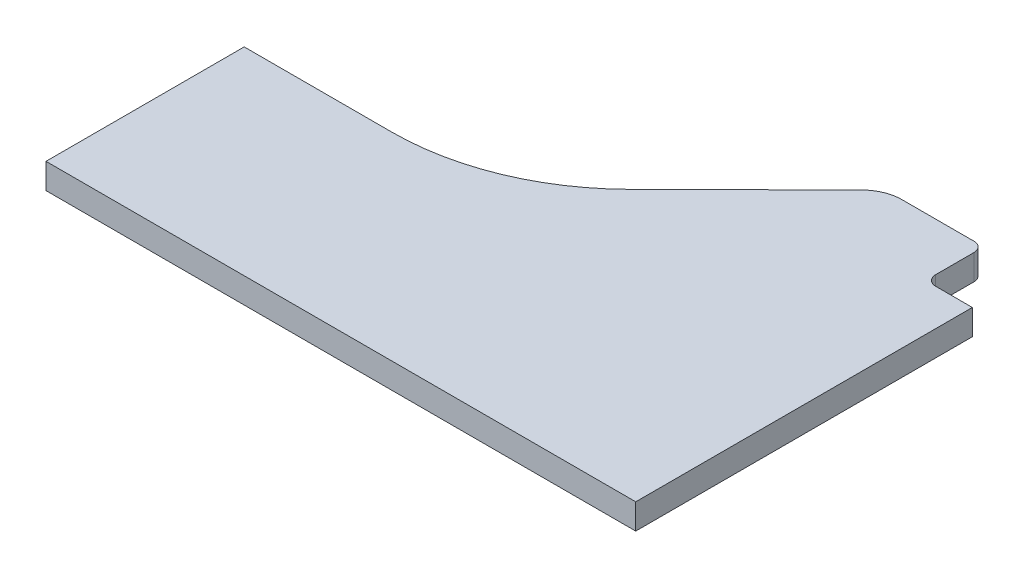
ISO-10303-21;
HEADER;
FILE_DESCRIPTION(('STEP AP214'),'2;1');
FILE_NAME('part.step','',(''),(''),'','','');
FILE_SCHEMA(('AUTOMOTIVE_DESIGN { 1 0 10303 214 1 1 1 1 }'));
ENDSEC;
DATA;
#1=APPLICATION_CONTEXT('core data for automotive mechanical design processes');
#2=APPLICATION_PROTOCOL_DEFINITION('international standard','automotive_design',2000,#1);
#3=PRODUCT_CONTEXT('',#1,'mechanical');
#4=PRODUCT('Part','Part','',(#3));
#5=PRODUCT_RELATED_PRODUCT_CATEGORY('part','',(#4));
#6=PRODUCT_DEFINITION_FORMATION('','',#4);
#7=PRODUCT_DEFINITION_CONTEXT('part definition',#1,'design');
#8=PRODUCT_DEFINITION('design','',#6,#7);
#9=PRODUCT_DEFINITION_SHAPE('','',#8);
#10=(LENGTH_UNIT() NAMED_UNIT(*) SI_UNIT(.MILLI.,.METRE.));
#11=(NAMED_UNIT(*) PLANE_ANGLE_UNIT() SI_UNIT($,.RADIAN.));
#12=(NAMED_UNIT(*) SI_UNIT($,.STERADIAN.) SOLID_ANGLE_UNIT());
#13=UNCERTAINTY_MEASURE_WITH_UNIT(LENGTH_MEASURE(1.E-05),#10,'distance_accuracy_value','');
#14=(GEOMETRIC_REPRESENTATION_CONTEXT(3) GLOBAL_UNCERTAINTY_ASSIGNED_CONTEXT((#13)) GLOBAL_UNIT_ASSIGNED_CONTEXT((#10,
#11,#12)) REPRESENTATION_CONTEXT('',''));
#15=CARTESIAN_POINT('',(0.,0.,0.));
#16=DIRECTION('',(0.,0.,1.));
#17=DIRECTION('',(1.,0.,0.));
#18=AXIS2_PLACEMENT_3D('',#15,#16,#17);
#19=CARTESIAN_POINT('',(0.,12.7,0.));
#20=DIRECTION('',(1.,0.,0.));
#21=DIRECTION('',(0.,0.,-1.));
#22=AXIS2_PLACEMENT_3D('',#19,#20,#21);
#23=PLANE('',#22);
#24=DIRECTION('',(0.,0.,1.));
#25=VECTOR('',#24,1.);
#26=CARTESIAN_POINT('',(0.,0.,0.));
#27=LINE('',#26,#25);
#28=CARTESIAN_POINT('',(0.,0.,-99.1471));
#29=VERTEX_POINT('',#28);
#30=CARTESIAN_POINT('',(0.,0.,0.));
#31=VERTEX_POINT('',#30);
#32=EDGE_CURVE('E153',#29,#31,#27,.T.);
#33=ORIENTED_EDGE('',*,*,#32,.T.);
#34=DIRECTION('',(0.,-1.,0.));
#35=VECTOR('',#34,1.);
#36=CARTESIAN_POINT('',(0.,12.7,0.));
#37=LINE('',#36,#35);
#38=CARTESIAN_POINT('',(0.,12.7,0.));
#39=VERTEX_POINT('',#38);
#40=EDGE_CURVE('E11',#39,#31,#37,.T.);
#41=ORIENTED_EDGE('',*,*,#40,.F.);
#42=DIRECTION('',(0.,0.,1.));
#43=VECTOR('',#42,1.);
#44=CARTESIAN_POINT('',(0.,12.7,0.));
#45=LINE('',#44,#43);
#46=CARTESIAN_POINT('',(0.,12.7,-99.1471));
#47=VERTEX_POINT('',#46);
#48=EDGE_CURVE('E175',#47,#39,#45,.T.);
#49=ORIENTED_EDGE('',*,*,#48,.F.);
#50=DIRECTION('',(0.,-1.,0.));
#51=VECTOR('',#50,1.);
#52=CARTESIAN_POINT('',(0.,12.7,-99.1471));
#53=LINE('',#52,#51);
#54=EDGE_CURVE('E149',#47,#29,#53,.T.);
#55=ORIENTED_EDGE('',*,*,#54,.T.);
#56=EDGE_LOOP('',(#33,#41,#49,#55));
#57=FACE_BOUND('',#56,.T.);
#58=ADVANCED_FACE('F33',(#57),#23,.F.);
#59=CARTESIAN_POINT('',(0.,12.7,0.));
#60=DIRECTION('',(0.,0.,-1.));
#61=DIRECTION('',(-1.,0.,0.));
#62=AXIS2_PLACEMENT_3D('',#59,#60,#61);
#63=PLANE('',#62);
#64=DIRECTION('',(1.,0.,0.));
#65=VECTOR('',#64,1.);
#66=CARTESIAN_POINT('',(0.,0.,0.));
#67=LINE('',#66,#65);
#68=CARTESIAN_POINT('',(295.,0.,0.));
#69=VERTEX_POINT('',#68);
#70=EDGE_CURVE('E156',#31,#69,#67,.T.);
#71=ORIENTED_EDGE('',*,*,#70,.T.);
#72=DIRECTION('',(0.,-1.,0.));
#73=VECTOR('',#72,1.);
#74=CARTESIAN_POINT('',(295.,12.7,0.));
#75=LINE('',#74,#73);
#76=CARTESIAN_POINT('',(295.,12.7,0.));
#77=VERTEX_POINT('',#76);
#78=EDGE_CURVE('E41',#77,#69,#75,.T.);
#79=ORIENTED_EDGE('',*,*,#78,.F.);
#80=DIRECTION('',(1.,0.,0.));
#81=VECTOR('',#80,1.);
#82=CARTESIAN_POINT('',(0.,12.7,0.));
#83=LINE('',#82,#81);
#84=EDGE_CURVE('E104',#39,#77,#83,.T.);
#85=ORIENTED_EDGE('',*,*,#84,.F.);
#86=ORIENTED_EDGE('',*,*,#40,.T.);
#87=EDGE_LOOP('',(#71,#79,#85,#86));
#88=FACE_BOUND('',#87,.T.);
#89=ADVANCED_FACE('F253',(#88),#63,.F.);
#90=CARTESIAN_POINT('',(295.,12.7,0.));
#91=DIRECTION('',(-1.,0.,0.));
#92=DIRECTION('',(0.,0.,1.));
#93=AXIS2_PLACEMENT_3D('',#90,#91,#92);
#94=PLANE('',#93);
#95=DIRECTION('',(0.,0.,-1.));
#96=VECTOR('',#95,1.);
#97=CARTESIAN_POINT('',(295.,0.,0.));
#98=LINE('',#97,#96);
#99=CARTESIAN_POINT('',(295.,0.,-168.379));
#100=VERTEX_POINT('',#99);
#101=EDGE_CURVE('E158',#69,#100,#98,.T.);
#102=ORIENTED_EDGE('',*,*,#101,.T.);
#103=DIRECTION('',(0.,-1.,0.));
#104=VECTOR('',#103,1.);
#105=CARTESIAN_POINT('',(295.,12.7,-168.379));
#106=LINE('',#105,#104);
#107=CARTESIAN_POINT('',(295.,12.7,-168.379));
#108=VERTEX_POINT('',#107);
#109=EDGE_CURVE('E194',#108,#100,#106,.T.);
#110=ORIENTED_EDGE('',*,*,#109,.F.);
#111=DIRECTION('',(0.,0.,-1.));
#112=VECTOR('',#111,1.);
#113=CARTESIAN_POINT('',(295.,12.7,0.));
#114=LINE('',#113,#112);
#115=EDGE_CURVE('E202',#77,#108,#114,.T.);
#116=ORIENTED_EDGE('',*,*,#115,.F.);
#117=ORIENTED_EDGE('',*,*,#78,.T.);
#118=EDGE_LOOP('',(#102,#110,#116,#117));
#119=FACE_BOUND('',#118,.T.);
#120=ADVANCED_FACE('F200',(#119),#94,.F.);
#121=CARTESIAN_POINT('',(295.,12.7,-168.379));
#122=DIRECTION('',(0.,0.,1.));
#123=DIRECTION('',(1.,0.,0.));
#124=AXIS2_PLACEMENT_3D('',#121,#122,#123);
#125=PLANE('',#124);
#126=DIRECTION('',(-1.,0.,0.));
#127=VECTOR('',#126,1.);
#128=CARTESIAN_POINT('',(295.,0.,-168.379));
#129=LINE('',#128,#127);
#130=CARTESIAN_POINT('',(276.6155,0.,-168.379));
#131=VERTEX_POINT('',#130);
#132=EDGE_CURVE('E160',#100,#131,#129,.T.);
#133=ORIENTED_EDGE('',*,*,#132,.T.);
#134=DIRECTION('',(0.,-1.,0.));
#135=VECTOR('',#134,1.);
#136=CARTESIAN_POINT('',(276.6155,12.7,-168.379));
#137=LINE('',#136,#135);
#138=CARTESIAN_POINT('',(276.6155,12.7,-168.379));
#139=VERTEX_POINT('',#138);
#140=EDGE_CURVE('E191',#139,#131,#137,.T.);
#141=ORIENTED_EDGE('',*,*,#140,.F.);
#142=DIRECTION('',(-1.,0.,0.));
#143=VECTOR('',#142,1.);
#144=CARTESIAN_POINT('',(295.,12.7,-168.379));
#145=LINE('',#144,#143);
#146=EDGE_CURVE('E220',#108,#139,#145,.T.);
#147=ORIENTED_EDGE('',*,*,#146,.F.);
#148=ORIENTED_EDGE('',*,*,#109,.T.);
#149=EDGE_LOOP('',(#133,#141,#147,#148));
#150=FACE_BOUND('',#149,.T.);
#151=ADVANCED_FACE('F211',(#150),#125,.F.);
#152=CARTESIAN_POINT('',(276.6155,12.7,-173.379));
#153=DIRECTION('',(0.,-1.,0.));
#154=DIRECTION('',(0.,0.,-1.));
#155=AXIS2_PLACEMENT_3D('',#152,#153,#154);
#156=CYLINDRICAL_SURFACE('',#155,5.);
#157=CARTESIAN_POINT('',(276.6155,0.,-173.379));
#158=DIRECTION('',(0.,-1.,0.));
#159=DIRECTION('',(0.,0.,1.));
#160=AXIS2_PLACEMENT_3D('',#157,#158,#159);
#161=CIRCLE('',#160,5.);
#162=CARTESIAN_POINT('',(271.6155,0.,-173.379));
#163=VERTEX_POINT('',#162);
#164=EDGE_CURVE('E162',#131,#163,#161,.T.);
#165=ORIENTED_EDGE('',*,*,#164,.T.);
#166=DIRECTION('',(0.,-1.,0.));
#167=VECTOR('',#166,1.);
#168=CARTESIAN_POINT('',(271.6155,12.7,-173.379));
#169=LINE('',#168,#167);
#170=CARTESIAN_POINT('',(271.6155,12.7,-173.379));
#171=VERTEX_POINT('',#170);
#172=EDGE_CURVE('E188',#171,#163,#169,.T.);
#173=ORIENTED_EDGE('',*,*,#172,.F.);
#174=CARTESIAN_POINT('',(276.6155,12.7,-173.379));
#175=DIRECTION('',(0.,-1.,0.));
#176=DIRECTION('',(0.,0.,1.));
#177=AXIS2_PLACEMENT_3D('',#174,#175,#176);
#178=CIRCLE('',#177,5.);
#179=EDGE_CURVE('E217',#139,#171,#178,.T.);
#180=ORIENTED_EDGE('',*,*,#179,.F.);
#181=ORIENTED_EDGE('',*,*,#140,.T.);
#182=EDGE_LOOP('',(#165,#173,#180,#181));
#183=FACE_BOUND('',#182,.T.);
#184=ADVANCED_FACE('F215',(#183),#156,.F.);
#185=CARTESIAN_POINT('',(271.6155,12.7,-173.379));
#186=DIRECTION('',(-1.,0.,0.));
#187=DIRECTION('',(0.,0.,1.));
#188=AXIS2_PLACEMENT_3D('',#185,#186,#187);
#189=PLANE('',#188);
#190=DIRECTION('',(0.,0.,-1.));
#191=VECTOR('',#190,1.);
#192=CARTESIAN_POINT('',(271.6155,0.,-173.379));
#193=LINE('',#192,#191);
#194=CARTESIAN_POINT('',(271.6155,0.,-192.53565981004));
#195=VERTEX_POINT('',#194);
#196=EDGE_CURVE('E164',#163,#195,#193,.T.);
#197=ORIENTED_EDGE('',*,*,#196,.T.);
#198=DIRECTION('',(0.,-1.,0.));
#199=VECTOR('',#198,1.);
#200=CARTESIAN_POINT('',(271.6155,12.7,-192.53565981004));
#201=LINE('',#200,#199);
#202=CARTESIAN_POINT('',(271.6155,12.7,-192.53565981004));
#203=VERTEX_POINT('',#202);
#204=EDGE_CURVE('E185',#203,#195,#201,.T.);
#205=ORIENTED_EDGE('',*,*,#204,.F.);
#206=DIRECTION('',(0.,0.,-1.));
#207=VECTOR('',#206,1.);
#208=CARTESIAN_POINT('',(271.6155,12.7,-173.379));
#209=LINE('',#208,#207);
#210=EDGE_CURVE('E219',#171,#203,#209,.T.);
#211=ORIENTED_EDGE('',*,*,#210,.F.);
#212=ORIENTED_EDGE('',*,*,#172,.T.);
#213=EDGE_LOOP('',(#197,#205,#211,#212));
#214=FACE_BOUND('',#213,.T.);
#215=ADVANCED_FACE('F266',(#214),#189,.F.);
#216=CARTESIAN_POINT('',(266.6155,12.7,-192.53565981004));
#217=DIRECTION('',(0.,-1.,0.));
#218=DIRECTION('',(0.,0.,-1.));
#219=AXIS2_PLACEMENT_3D('',#216,#217,#218);
#220=CYLINDRICAL_SURFACE('',#219,5.);
#221=CARTESIAN_POINT('',(266.6155,0.,-192.53565981004));
#222=DIRECTION('',(0.,1.,0.));
#223=DIRECTION('',(0.,0.,1.));
#224=AXIS2_PLACEMENT_3D('',#221,#222,#223);
#225=CIRCLE('',#224,5.);
#226=CARTESIAN_POINT('',(265.947279680753,0.,-197.490806791204));
#227=VERTEX_POINT('',#226);
#228=EDGE_CURVE('E166',#195,#227,#225,.T.);
#229=ORIENTED_EDGE('',*,*,#228,.T.);
#230=DIRECTION('',(0.,-1.,0.));
#231=VECTOR('',#230,1.);
#232=CARTESIAN_POINT('',(265.947279680753,12.7,-197.490806791204));
#233=LINE('',#232,#231);
#234=CARTESIAN_POINT('',(265.947279680753,12.7,-197.490806791204));
#235=VERTEX_POINT('',#234);
#236=EDGE_CURVE('E182',#235,#227,#233,.T.);
#237=ORIENTED_EDGE('',*,*,#236,.F.);
#238=CARTESIAN_POINT('',(266.6155,12.7,-192.53565981004));
#239=DIRECTION('',(0.,1.,0.));
#240=DIRECTION('',(0.,0.,1.));
#241=AXIS2_PLACEMENT_3D('',#238,#239,#240);
#242=CIRCLE('',#241,5.);
#243=EDGE_CURVE('E222',#203,#235,#242,.T.);
#244=ORIENTED_EDGE('',*,*,#243,.F.);
#245=ORIENTED_EDGE('',*,*,#204,.T.);
#246=EDGE_LOOP('',(#229,#237,#244,#245));
#247=FACE_BOUND('',#246,.T.);
#248=ADVANCED_FACE('F269',(#247),#220,.T.);
#249=CARTESIAN_POINT('',(265.947279680753,12.7,-197.490806791204));
#250=DIRECTION('',(0.,0.,1.));
#251=DIRECTION('',(1.,0.,0.));
#252=AXIS2_PLACEMENT_3D('',#249,#250,#251);
#253=PLANE('',#252);
#254=DIRECTION('',(-1.,0.,0.));
#255=VECTOR('',#254,1.);
#256=CARTESIAN_POINT('',(265.947279680753,0.,-197.490806791204));
#257=LINE('',#256,#255);
#258=CARTESIAN_POINT('',(230.644359426485,0.,-197.490806791204));
#259=VERTEX_POINT('',#258);
#260=EDGE_CURVE('E168',#227,#259,#257,.T.);
#261=ORIENTED_EDGE('',*,*,#260,.T.);
#262=DIRECTION('',(0.,-1.,0.));
#263=VECTOR('',#262,1.);
#264=CARTESIAN_POINT('',(230.644359426485,12.7,-197.490806791204));
#265=LINE('',#264,#263);
#266=CARTESIAN_POINT('',(230.644359426485,12.7,-197.490806791204));
#267=VERTEX_POINT('',#266);
#268=EDGE_CURVE('E179',#267,#259,#265,.T.);
#269=ORIENTED_EDGE('',*,*,#268,.F.);
#270=DIRECTION('',(-1.,0.,0.));
#271=VECTOR('',#270,1.);
#272=CARTESIAN_POINT('',(265.947279680753,12.7,-197.490806791204));
#273=LINE('',#272,#271);
#274=EDGE_CURVE('E228',#235,#267,#273,.T.);
#275=ORIENTED_EDGE('',*,*,#274,.F.);
#276=ORIENTED_EDGE('',*,*,#236,.T.);
#277=EDGE_LOOP('',(#261,#269,#275,#276));
#278=FACE_BOUND('',#277,.T.);
#279=ADVANCED_FACE('F234',(#278),#253,.F.);
#280=CARTESIAN_POINT('',(230.644359426485,12.7,-177.490806791204));
#281=DIRECTION('',(0.,-1.,0.));
#282=DIRECTION('',(0.,0.,-1.));
#283=AXIS2_PLACEMENT_3D('',#280,#281,#282);
#284=CYLINDRICAL_SURFACE('',#283,20.);
#285=CARTESIAN_POINT('',(230.644359426485,0.,-177.490806791204));
#286=DIRECTION('',(0.,1.,0.));
#287=DIRECTION('',(0.,0.,-1.));
#288=AXIS2_PLACEMENT_3D('',#285,#286,#287);
#289=CIRCLE('',#288,20.);
#290=CARTESIAN_POINT('',(216.573545734308,0.,-191.703906454545));
#291=VERTEX_POINT('',#290);
#292=EDGE_CURVE('E170',#259,#291,#289,.T.);
#293=ORIENTED_EDGE('',*,*,#292,.T.);
#294=DIRECTION('',(0.,-1.,0.));
#295=VECTOR('',#294,1.);
#296=CARTESIAN_POINT('',(216.573545734308,12.7,-191.703906454545));
#297=LINE('',#296,#295);
#298=CARTESIAN_POINT('',(216.573545734308,12.7,-191.703906454545));
#299=VERTEX_POINT('',#298);
#300=EDGE_CURVE('E144',#299,#291,#297,.T.);
#301=ORIENTED_EDGE('',*,*,#300,.F.);
#302=CARTESIAN_POINT('',(230.644359426485,12.7,-177.490806791204));
#303=DIRECTION('',(0.,1.,0.));
#304=DIRECTION('',(0.,0.,-1.));
#305=AXIS2_PLACEMENT_3D('',#302,#303,#304);
#306=CIRCLE('',#305,20.);
#307=EDGE_CURVE('E135',#267,#299,#306,.T.);
#308=ORIENTED_EDGE('',*,*,#307,.F.);
#309=ORIENTED_EDGE('',*,*,#268,.T.);
#310=EDGE_LOOP('',(#293,#301,#308,#309));
#311=FACE_BOUND('',#310,.T.);
#312=ADVANCED_FACE('F238',(#311),#284,.T.);
#313=CARTESIAN_POINT('',(158.153301867716,12.7,-133.868502019958));
#314=DIRECTION('',(0.703540684608853,0.,0.710654983167012));
#315=DIRECTION('',(0.710654983167012,0.,-0.703540684608853));
#316=AXIS2_PLACEMENT_3D('',#313,#314,#315);
#317=PLANE('',#316);
#318=DIRECTION('',(-0.710654983167012,0.,0.703540684608853));
#319=VECTOR('',#318,1.);
#320=CARTESIAN_POINT('',(158.153301867716,0.,-133.868502019958));
#321=LINE('',#320,#319);
#322=CARTESIAN_POINT('',(158.153301867716,0.,-133.868502019958));
#323=VERTEX_POINT('',#322);
#324=EDGE_CURVE('E143',#291,#323,#321,.T.);
#325=ORIENTED_EDGE('',*,*,#324,.T.);
#326=DIRECTION('',(0.,-1.,0.));
#327=VECTOR('',#326,1.);
#328=CARTESIAN_POINT('',(158.153301867716,12.7,-133.868502019958));
#329=LINE('',#328,#327);
#330=CARTESIAN_POINT('',(158.153301867716,12.7,-133.868502019958));
#331=VERTEX_POINT('',#330);
#332=EDGE_CURVE('E140',#331,#323,#329,.T.);
#333=ORIENTED_EDGE('',*,*,#332,.F.);
#334=DIRECTION('',(-0.710654983167012,0.,0.703540684608853));
#335=VECTOR('',#334,1.);
#336=CARTESIAN_POINT('',(158.153301867716,12.7,-133.868502019958));
#337=LINE('',#336,#335);
#338=EDGE_CURVE('E129',#299,#331,#337,.T.);
#339=ORIENTED_EDGE('',*,*,#338,.F.);
#340=ORIENTED_EDGE('',*,*,#300,.T.);
#341=EDGE_LOOP('',(#325,#333,#339,#340));
#342=FACE_BOUND('',#341,.T.);
#343=ADVANCED_FACE('F141',(#342),#317,.F.);
#344=CARTESIAN_POINT('',(73.7284197146536,12.7,-219.1471));
#345=DIRECTION('',(0.,-1.,0.));
#346=DIRECTION('',(0.,0.,-1.));
#347=AXIS2_PLACEMENT_3D('',#344,#345,#346);
#348=CYLINDRICAL_SURFACE('',#347,120.);
#349=CARTESIAN_POINT('',(73.7284197146536,0.,-219.1471));
#350=DIRECTION('',(0.,-1.,0.));
#351=DIRECTION('',(0.,0.,1.));
#352=AXIS2_PLACEMENT_3D('',#349,#350,#351);
#353=CIRCLE('',#352,120.);
#354=CARTESIAN_POINT('',(73.728419714653,0.,-99.1471));
#355=VERTEX_POINT('',#354);
#356=EDGE_CURVE('E90',#323,#355,#353,.T.);
#357=ORIENTED_EDGE('',*,*,#356,.T.);
#358=DIRECTION('',(0.,-1.,0.));
#359=VECTOR('',#358,1.);
#360=CARTESIAN_POINT('',(73.728419714653,12.7,-99.1471));
#361=LINE('',#360,#359);
#362=CARTESIAN_POINT('',(73.728419714653,12.7,-99.1471));
#363=VERTEX_POINT('',#362);
#364=EDGE_CURVE('E145',#363,#355,#361,.T.);
#365=ORIENTED_EDGE('',*,*,#364,.F.);
#366=CARTESIAN_POINT('',(73.7284197146536,12.7,-219.1471));
#367=DIRECTION('',(0.,-1.,0.));
#368=DIRECTION('',(0.,0.,1.));
#369=AXIS2_PLACEMENT_3D('',#366,#367,#368);
#370=CIRCLE('',#369,120.);
#371=EDGE_CURVE('E133',#331,#363,#370,.T.);
#372=ORIENTED_EDGE('',*,*,#371,.F.);
#373=ORIENTED_EDGE('',*,*,#332,.T.);
#374=EDGE_LOOP('',(#357,#365,#372,#373));
#375=FACE_BOUND('',#374,.T.);
#376=ADVANCED_FACE('F147',(#375),#348,.F.);
#377=CARTESIAN_POINT('',(0.,12.7,-99.1471));
#378=DIRECTION('',(0.,0.,1.));
#379=DIRECTION('',(1.,0.,0.));
#380=AXIS2_PLACEMENT_3D('',#377,#378,#379);
#381=PLANE('',#380);
#382=DIRECTION('',(-1.,0.,0.));
#383=VECTOR('',#382,1.);
#384=CARTESIAN_POINT('',(0.,0.,-99.1471));
#385=LINE('',#384,#383);
#386=EDGE_CURVE('E96',#355,#29,#385,.T.);
#387=ORIENTED_EDGE('',*,*,#386,.T.);
#388=ORIENTED_EDGE('',*,*,#54,.F.);
#389=DIRECTION('',(-1.,0.,0.));
#390=VECTOR('',#389,1.);
#391=CARTESIAN_POINT('',(0.,12.7,-99.1471));
#392=LINE('',#391,#390);
#393=EDGE_CURVE('E49',#363,#47,#392,.T.);
#394=ORIENTED_EDGE('',*,*,#393,.F.);
#395=ORIENTED_EDGE('',*,*,#364,.T.);
#396=EDGE_LOOP('',(#387,#388,#394,#395));
#397=FACE_BOUND('',#396,.T.);
#398=ADVANCED_FACE('F242',(#397),#381,.F.);
#399=CARTESIAN_POINT('',(73.7284197146536,12.7,-219.1471));
#400=DIRECTION('',(0.,1.,0.));
#401=DIRECTION('',(0.,0.,1.));
#402=AXIS2_PLACEMENT_3D('',#399,#400,#401);
#403=PLANE('',#402);
#404=ORIENTED_EDGE('',*,*,#48,.T.);
#405=ORIENTED_EDGE('',*,*,#84,.T.);
#406=ORIENTED_EDGE('',*,*,#115,.T.);
#407=ORIENTED_EDGE('',*,*,#146,.T.);
#408=ORIENTED_EDGE('',*,*,#179,.T.);
#409=ORIENTED_EDGE('',*,*,#210,.T.);
#410=ORIENTED_EDGE('',*,*,#243,.T.);
#411=ORIENTED_EDGE('',*,*,#274,.T.);
#412=ORIENTED_EDGE('',*,*,#307,.T.);
#413=ORIENTED_EDGE('',*,*,#338,.T.);
#414=ORIENTED_EDGE('',*,*,#371,.T.);
#415=ORIENTED_EDGE('',*,*,#393,.T.);
#416=EDGE_LOOP('',(#404,#405,#406,#407,#408,#409,#410,#411,#412,#413,#414,#415));
#417=FACE_BOUND('',#416,.T.);
#418=ADVANCED_FACE('F131',(#417),#403,.T.);
#419=CARTESIAN_POINT('',(73.7284197146536,0.,-219.1471));
#420=DIRECTION('',(0.,1.,0.));
#421=DIRECTION('',(0.,0.,1.));
#422=AXIS2_PLACEMENT_3D('',#419,#420,#421);
#423=PLANE('',#422);
#424=ORIENTED_EDGE('',*,*,#32,.F.);
#425=ORIENTED_EDGE('',*,*,#386,.F.);
#426=ORIENTED_EDGE('',*,*,#356,.F.);
#427=ORIENTED_EDGE('',*,*,#324,.F.);
#428=ORIENTED_EDGE('',*,*,#292,.F.);
#429=ORIENTED_EDGE('',*,*,#260,.F.);
#430=ORIENTED_EDGE('',*,*,#228,.F.);
#431=ORIENTED_EDGE('',*,*,#196,.F.);
#432=ORIENTED_EDGE('',*,*,#164,.F.);
#433=ORIENTED_EDGE('',*,*,#132,.F.);
#434=ORIENTED_EDGE('',*,*,#101,.F.);
#435=ORIENTED_EDGE('',*,*,#70,.F.);
#436=EDGE_LOOP('',(#424,#425,#426,#427,#428,#429,#430,#431,#432,#433,#434,#435));
#437=FACE_BOUND('',#436,.T.);
#438=ADVANCED_FACE('F206',(#437),#423,.F.);
#439=CLOSED_SHELL('',(#58,#89,#120,#151,#184,#215,#248,#279,#312,#343,#376,#398,#418,#438));
#440=MANIFOLD_SOLID_BREP('B2',#439);
#441=ADVANCED_BREP_SHAPE_REPRESENTATION('',(#18,#440),#14);
#442=SHAPE_DEFINITION_REPRESENTATION(#9,#441);
ENDSEC;
END-ISO-10303-21;
